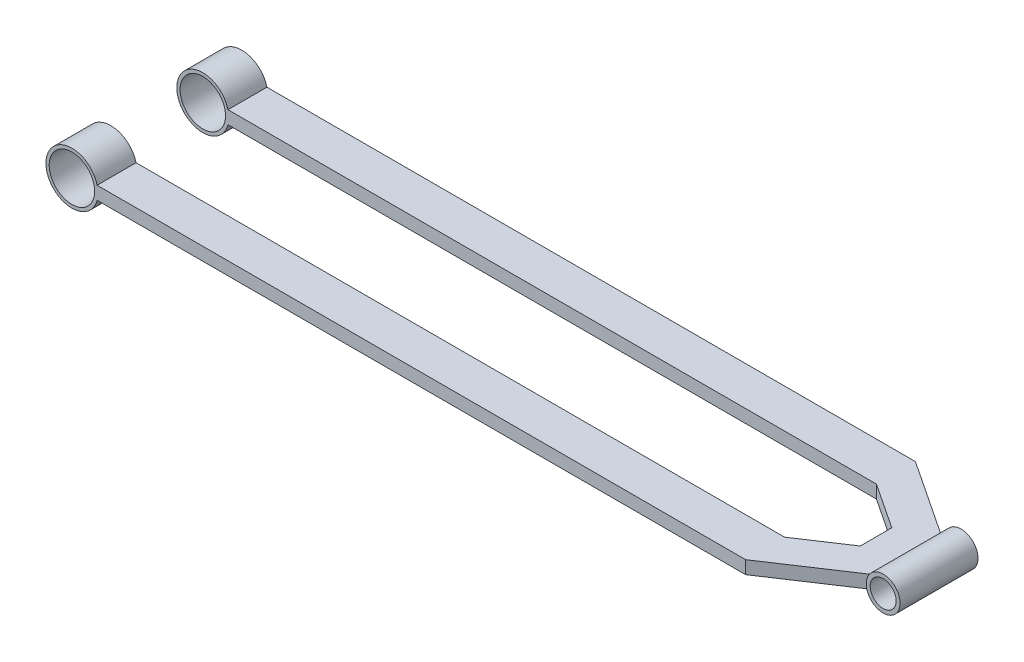
ISO-10303-21;
HEADER;
FILE_DESCRIPTION(('STEP AP214'),'2;1');
FILE_NAME('part.step','',(''),(''),'','','');
FILE_SCHEMA(('AUTOMOTIVE_DESIGN { 1 0 10303 214 1 1 1 1 }'));
ENDSEC;
DATA;
#1=APPLICATION_CONTEXT('core data for automotive mechanical design processes');
#2=APPLICATION_PROTOCOL_DEFINITION('international standard','automotive_design',2000,#1);
#3=PRODUCT_CONTEXT('',#1,'mechanical');
#4=PRODUCT('Part','Part','',(#3));
#5=PRODUCT_RELATED_PRODUCT_CATEGORY('part','',(#4));
#6=PRODUCT_DEFINITION_FORMATION('','',#4);
#7=PRODUCT_DEFINITION_CONTEXT('part definition',#1,'design');
#8=PRODUCT_DEFINITION('design','',#6,#7);
#9=PRODUCT_DEFINITION_SHAPE('','',#8);
#10=(LENGTH_UNIT() NAMED_UNIT(*) SI_UNIT(.MILLI.,.METRE.));
#11=(NAMED_UNIT(*) PLANE_ANGLE_UNIT() SI_UNIT($,.RADIAN.));
#12=(NAMED_UNIT(*) SI_UNIT($,.STERADIAN.) SOLID_ANGLE_UNIT());
#13=UNCERTAINTY_MEASURE_WITH_UNIT(LENGTH_MEASURE(1.E-05),#10,'distance_accuracy_value','');
#14=(GEOMETRIC_REPRESENTATION_CONTEXT(3) GLOBAL_UNCERTAINTY_ASSIGNED_CONTEXT((#13)) GLOBAL_UNIT_ASSIGNED_CONTEXT((#10,
#11,#12)) REPRESENTATION_CONTEXT('',''));
#15=CARTESIAN_POINT('',(0.,0.,0.));
#16=DIRECTION('',(0.,0.,1.));
#17=DIRECTION('',(1.,0.,0.));
#18=AXIS2_PLACEMENT_3D('',#15,#16,#17);
#19=CARTESIAN_POINT('',(0.,5.,0.));
#20=DIRECTION('',(0.,-1.,0.));
#21=DIRECTION('',(0.,0.,-1.));
#22=AXIS2_PLACEMENT_3D('',#19,#20,#21);
#23=PLANE('',#22);
#24=DIRECTION('',(0.,0.,-1.));
#25=VECTOR('',#24,1.);
#26=CARTESIAN_POINT('',(577.,5.,30.));
#27=LINE('',#26,#25);
#28=CARTESIAN_POINT('',(577.,5.,-26.550489952842));
#29=VERTEX_POINT('',#28);
#30=CARTESIAN_POINT('',(577.,5.,26.5504899528419));
#31=VERTEX_POINT('',#30);
#32=EDGE_CURVE('E144',#29,#31,#27,.F.);
#33=ORIENTED_EDGE('',*,*,#32,.F.);
#34=DIRECTION('',(-0.833333333333335,0.,-0.552770798392565));
#35=VECTOR('',#34,1.);
#36=CARTESIAN_POINT('',(578.5,5.,-25.5555025157354));
#37=LINE('',#36,#35);
#38=CARTESIAN_POINT('',(518.5,5.,-65.355));
#39=VERTEX_POINT('',#38);
#40=EDGE_CURVE('E132',#29,#39,#37,.T.);
#41=ORIENTED_EDGE('',*,*,#40,.T.);
#42=DIRECTION('',(-1.,0.,0.));
#43=VECTOR('',#42,1.);
#44=CARTESIAN_POINT('',(18.5,5.,-65.355));
#45=LINE('',#44,#43);
#46=CARTESIAN_POINT('',(19.3649167310371,5.,-65.355));
#47=VERTEX_POINT('',#46);
#48=EDGE_CURVE('E140',#39,#47,#45,.T.);
#49=ORIENTED_EDGE('',*,*,#48,.T.);
#50=DIRECTION('',(0.,0.,1.));
#51=VECTOR('',#50,1.);
#52=CARTESIAN_POINT('',(19.3649167310371,5.,-65.355));
#53=LINE('',#52,#51);
#54=CARTESIAN_POINT('',(19.3649167310371,5.,-35.355));
#55=VERTEX_POINT('',#54);
#56=EDGE_CURVE('E223',#55,#47,#53,.F.);
#57=ORIENTED_EDGE('',*,*,#56,.F.);
#58=DIRECTION('',(1.,0.,0.));
#59=VECTOR('',#58,1.);
#60=CARTESIAN_POINT('',(18.5,5.,-35.355));
#61=LINE('',#60,#59);
#62=CARTESIAN_POINT('',(518.5,5.,-35.355));
#63=VERTEX_POINT('',#62);
#64=EDGE_CURVE('E175',#55,#63,#61,.T.);
#65=ORIENTED_EDGE('',*,*,#64,.T.);
#66=DIRECTION('',(0.833333333333335,0.,0.552770798392565));
#67=VECTOR('',#66,1.);
#68=CARTESIAN_POINT('',(553.5,5.,-12.1386264675124));
#69=LINE('',#68,#67);
#70=CARTESIAN_POINT('',(553.5,5.,-12.1386264675124));
#71=VERTEX_POINT('',#70);
#72=EDGE_CURVE('E177',#63,#71,#69,.T.);
#73=ORIENTED_EDGE('',*,*,#72,.T.);
#74=DIRECTION('',(0.,0.,1.));
#75=VECTOR('',#74,1.);
#76=CARTESIAN_POINT('',(553.5,5.,12.1386264675123));
#77=LINE('',#76,#75);
#78=CARTESIAN_POINT('',(553.5,5.,12.1386264675123));
#79=VERTEX_POINT('',#78);
#80=EDGE_CURVE('E179',#71,#79,#77,.T.);
#81=ORIENTED_EDGE('',*,*,#80,.T.);
#82=DIRECTION('',(-0.833333333333334,0.,0.552770798392566));
#83=VECTOR('',#82,1.);
#84=CARTESIAN_POINT('',(518.5,5.,35.355));
#85=LINE('',#84,#83);
#86=CARTESIAN_POINT('',(518.5,5.,35.355));
#87=VERTEX_POINT('',#86);
#88=EDGE_CURVE('E181',#79,#87,#85,.T.);
#89=ORIENTED_EDGE('',*,*,#88,.T.);
#90=DIRECTION('',(-1.,0.,0.));
#91=VECTOR('',#90,1.);
#92=CARTESIAN_POINT('',(18.5,5.,35.355));
#93=LINE('',#92,#91);
#94=CARTESIAN_POINT('',(19.3649167310371,5.,35.355));
#95=VERTEX_POINT('',#94);
#96=EDGE_CURVE('E183',#87,#95,#93,.T.);
#97=ORIENTED_EDGE('',*,*,#96,.T.);
#98=DIRECTION('',(0.,0.,-1.));
#99=VECTOR('',#98,1.);
#100=CARTESIAN_POINT('',(19.3649167310371,5.,65.355));
#101=LINE('',#100,#99);
#102=CARTESIAN_POINT('',(19.3649167310371,5.,65.355));
#103=VERTEX_POINT('',#102);
#104=EDGE_CURVE('E166',#103,#95,#101,.T.);
#105=ORIENTED_EDGE('',*,*,#104,.F.);
#106=DIRECTION('',(1.,0.,0.));
#107=VECTOR('',#106,1.);
#108=CARTESIAN_POINT('',(18.5,5.,65.355));
#109=LINE('',#108,#107);
#110=CARTESIAN_POINT('',(518.5,5.,65.355));
#111=VERTEX_POINT('',#110);
#112=EDGE_CURVE('E170',#103,#111,#109,.T.);
#113=ORIENTED_EDGE('',*,*,#112,.T.);
#114=DIRECTION('',(0.833333333333334,0.,-0.552770798392566));
#115=VECTOR('',#114,1.);
#116=CARTESIAN_POINT('',(518.5,5.,65.355));
#117=LINE('',#116,#115);
#118=EDGE_CURVE('E141',#111,#31,#117,.T.);
#119=ORIENTED_EDGE('',*,*,#118,.T.);
#120=EDGE_LOOP('',(#33,#41,#49,#57,#65,#73,#81,#89,#97,#105,#113,#119));
#121=FACE_BOUND('',#120,.T.);
#122=ADVANCED_FACE('F41',(#121),#23,.F.);
#123=CARTESIAN_POINT('',(0.,-5.,0.));
#124=DIRECTION('',(0.,-1.,0.));
#125=DIRECTION('',(0.,0.,-1.));
#126=AXIS2_PLACEMENT_3D('',#123,#124,#125);
#127=PLANE('',#126);
#128=DIRECTION('',(-0.833333333333335,0.,-0.552770798392565));
#129=VECTOR('',#128,1.);
#130=CARTESIAN_POINT('',(578.5,-5.,-25.5555025157354));
#131=LINE('',#130,#129);
#132=CARTESIAN_POINT('',(577.,-5.,-26.550489952842));
#133=VERTEX_POINT('',#132);
#134=CARTESIAN_POINT('',(518.5,-5.,-65.355));
#135=VERTEX_POINT('',#134);
#136=EDGE_CURVE('E190',#133,#135,#131,.T.);
#137=ORIENTED_EDGE('',*,*,#136,.F.);
#138=DIRECTION('',(0.,0.,-1.));
#139=VECTOR('',#138,1.);
#140=CARTESIAN_POINT('',(577.,-5.,30.));
#141=LINE('',#140,#139);
#142=CARTESIAN_POINT('',(577.,-5.,26.5504899528419));
#143=VERTEX_POINT('',#142);
#144=EDGE_CURVE('E64',#133,#143,#141,.F.);
#145=ORIENTED_EDGE('',*,*,#144,.T.);
#146=DIRECTION('',(0.833333333333334,0.,-0.552770798392566));
#147=VECTOR('',#146,1.);
#148=CARTESIAN_POINT('',(518.5,-5.,65.355));
#149=LINE('',#148,#147);
#150=CARTESIAN_POINT('',(518.5,-5.,65.355));
#151=VERTEX_POINT('',#150);
#152=EDGE_CURVE('E188',#151,#143,#149,.T.);
#153=ORIENTED_EDGE('',*,*,#152,.F.);
#154=DIRECTION('',(1.,0.,0.));
#155=VECTOR('',#154,1.);
#156=CARTESIAN_POINT('',(18.5,-5.,65.355));
#157=LINE('',#156,#155);
#158=CARTESIAN_POINT('',(19.3649167310371,-5.,65.355));
#159=VERTEX_POINT('',#158);
#160=EDGE_CURVE('E169',#159,#151,#157,.T.);
#161=ORIENTED_EDGE('',*,*,#160,.F.);
#162=DIRECTION('',(0.,0.,-1.));
#163=VECTOR('',#162,1.);
#164=CARTESIAN_POINT('',(19.3649167310371,-5.,65.355));
#165=LINE('',#164,#163);
#166=CARTESIAN_POINT('',(19.3649167310371,-5.,35.355));
#167=VERTEX_POINT('',#166);
#168=EDGE_CURVE('E49',#159,#167,#165,.T.);
#169=ORIENTED_EDGE('',*,*,#168,.T.);
#170=DIRECTION('',(-1.,0.,0.));
#171=VECTOR('',#170,1.);
#172=CARTESIAN_POINT('',(18.5,-5.,35.355));
#173=LINE('',#172,#171);
#174=CARTESIAN_POINT('',(518.5,-5.,35.355));
#175=VERTEX_POINT('',#174);
#176=EDGE_CURVE('E172',#175,#167,#173,.T.);
#177=ORIENTED_EDGE('',*,*,#176,.F.);
#178=DIRECTION('',(-0.833333333333334,0.,0.552770798392566));
#179=VECTOR('',#178,1.);
#180=CARTESIAN_POINT('',(518.5,-5.,35.355));
#181=LINE('',#180,#179);
#182=CARTESIAN_POINT('',(553.5,-5.,12.1386264675123));
#183=VERTEX_POINT('',#182);
#184=EDGE_CURVE('E201',#183,#175,#181,.T.);
#185=ORIENTED_EDGE('',*,*,#184,.F.);
#186=DIRECTION('',(0.,0.,1.));
#187=VECTOR('',#186,1.);
#188=CARTESIAN_POINT('',(553.5,-5.,12.1386264675123));
#189=LINE('',#188,#187);
#190=CARTESIAN_POINT('',(553.5,-5.,-12.1386264675124));
#191=VERTEX_POINT('',#190);
#192=EDGE_CURVE('E199',#191,#183,#189,.T.);
#193=ORIENTED_EDGE('',*,*,#192,.F.);
#194=DIRECTION('',(0.833333333333335,0.,0.552770798392565));
#195=VECTOR('',#194,1.);
#196=CARTESIAN_POINT('',(553.5,-5.,-12.1386264675124));
#197=LINE('',#196,#195);
#198=CARTESIAN_POINT('',(518.5,-5.,-35.355));
#199=VERTEX_POINT('',#198);
#200=EDGE_CURVE('E197',#199,#191,#197,.T.);
#201=ORIENTED_EDGE('',*,*,#200,.F.);
#202=DIRECTION('',(1.,0.,0.));
#203=VECTOR('',#202,1.);
#204=CARTESIAN_POINT('',(18.5,-5.,-35.355));
#205=LINE('',#204,#203);
#206=CARTESIAN_POINT('',(19.3649167310371,-5.,-35.355));
#207=VERTEX_POINT('',#206);
#208=EDGE_CURVE('E195',#207,#199,#205,.T.);
#209=ORIENTED_EDGE('',*,*,#208,.F.);
#210=DIRECTION('',(0.,0.,1.));
#211=VECTOR('',#210,1.);
#212=CARTESIAN_POINT('',(19.3649167310371,-5.,-65.355));
#213=LINE('',#212,#211);
#214=CARTESIAN_POINT('',(19.3649167310371,-5.,-65.355));
#215=VERTEX_POINT('',#214);
#216=EDGE_CURVE('E220',#207,#215,#213,.F.);
#217=ORIENTED_EDGE('',*,*,#216,.T.);
#218=DIRECTION('',(-1.,0.,0.));
#219=VECTOR('',#218,1.);
#220=CARTESIAN_POINT('',(18.5,-5.,-65.355));
#221=LINE('',#220,#219);
#222=EDGE_CURVE('E192',#135,#215,#221,.T.);
#223=ORIENTED_EDGE('',*,*,#222,.F.);
#224=EDGE_LOOP('',(#137,#145,#153,#161,#169,#177,#185,#193,#201,#209,#217,#223));
#225=FACE_BOUND('',#224,.T.);
#226=ADVANCED_FACE('F238',(#225),#127,.T.);
#227=CARTESIAN_POINT('',(0.,0.,-65.355));
#228=DIRECTION('',(0.,0.,1.));
#229=DIRECTION('',(1.,0.,0.));
#230=AXIS2_PLACEMENT_3D('',#227,#228,#229);
#231=CYLINDRICAL_SURFACE('',#230,20.);
#232=CARTESIAN_POINT('',(0.,0.,-35.355));
#233=DIRECTION('',(0.,0.,1.));
#234=DIRECTION('',(1.,0.,0.));
#235=AXIS2_PLACEMENT_3D('',#232,#233,#234);
#236=CIRCLE('',#235,20.);
#237=EDGE_CURVE('E229',#55,#207,#236,.T.);
#238=ORIENTED_EDGE('',*,*,#237,.F.);
#239=ORIENTED_EDGE('',*,*,#56,.T.);
#240=CARTESIAN_POINT('',(0.,0.,-65.355));
#241=DIRECTION('',(0.,0.,1.));
#242=DIRECTION('',(1.,0.,0.));
#243=AXIS2_PLACEMENT_3D('',#240,#241,#242);
#244=CIRCLE('',#243,20.);
#245=EDGE_CURVE('E232',#47,#215,#244,.T.);
#246=ORIENTED_EDGE('',*,*,#245,.T.);
#247=ORIENTED_EDGE('',*,*,#216,.F.);
#248=EDGE_LOOP('',(#238,#239,#246,#247));
#249=FACE_BOUND('',#248,.T.);
#250=ADVANCED_FACE('F43',(#249),#231,.T.);
#251=CARTESIAN_POINT('',(0.,0.,-65.355));
#252=DIRECTION('',(0.,0.,1.));
#253=DIRECTION('',(1.,0.,0.));
#254=AXIS2_PLACEMENT_3D('',#251,#252,#253);
#255=PLANE('',#254);
#256=ORIENTED_EDGE('',*,*,#245,.F.);
#257=ORIENTED_EDGE('',*,*,#48,.F.);
#258=DIRECTION('',(0.,-1.,0.));
#259=VECTOR('',#258,1.);
#260=CARTESIAN_POINT('',(518.5,5.,-65.355));
#261=LINE('',#260,#259);
#262=EDGE_CURVE('E136',#39,#135,#261,.T.);
#263=ORIENTED_EDGE('',*,*,#262,.T.);
#264=ORIENTED_EDGE('',*,*,#222,.T.);
#265=EDGE_LOOP('',(#256,#257,#263,#264));
#266=FACE_BOUND('',#265,.T.);
#267=CARTESIAN_POINT('',(0.,0.,-65.355));
#268=DIRECTION('',(0.,0.,1.));
#269=DIRECTION('',(1.,0.,0.));
#270=AXIS2_PLACEMENT_3D('',#267,#268,#269);
#271=CIRCLE('',#270,17.5);
#272=CARTESIAN_POINT('',(17.5,0.,-65.355));
#273=VERTEX_POINT('',#272);
#274=EDGE_CURVE('E226',#273,#273,#271,.T.);
#275=ORIENTED_EDGE('',*,*,#274,.T.);
#276=EDGE_LOOP('',(#275));
#277=FACE_BOUND('',#276,.T.);
#278=ADVANCED_FACE('F270',(#266,#277),#255,.F.);
#279=CARTESIAN_POINT('',(0.,0.,-35.355));
#280=DIRECTION('',(0.,0.,1.));
#281=DIRECTION('',(1.,0.,0.));
#282=AXIS2_PLACEMENT_3D('',#279,#280,#281);
#283=PLANE('',#282);
#284=ORIENTED_EDGE('',*,*,#237,.T.);
#285=ORIENTED_EDGE('',*,*,#208,.T.);
#286=DIRECTION('',(0.,-1.,0.));
#287=VECTOR('',#286,1.);
#288=CARTESIAN_POINT('',(518.5,5.,-35.355));
#289=LINE('',#288,#287);
#290=EDGE_CURVE('E213',#63,#199,#289,.T.);
#291=ORIENTED_EDGE('',*,*,#290,.F.);
#292=ORIENTED_EDGE('',*,*,#64,.F.);
#293=EDGE_LOOP('',(#284,#285,#291,#292));
#294=FACE_BOUND('',#293,.T.);
#295=CARTESIAN_POINT('',(0.,0.,-35.355));
#296=DIRECTION('',(0.,0.,1.));
#297=DIRECTION('',(1.,0.,0.));
#298=AXIS2_PLACEMENT_3D('',#295,#296,#297);
#299=CIRCLE('',#298,17.5);
#300=CARTESIAN_POINT('',(17.5,0.,-35.355));
#301=VERTEX_POINT('',#300);
#302=EDGE_CURVE('E225',#301,#301,#299,.T.);
#303=ORIENTED_EDGE('',*,*,#302,.F.);
#304=EDGE_LOOP('',(#303));
#305=FACE_BOUND('',#304,.T.);
#306=ADVANCED_FACE('F264',(#294,#305),#283,.T.);
#307=CARTESIAN_POINT('',(0.,0.,-65.355));
#308=DIRECTION('',(0.,0.,1.));
#309=DIRECTION('',(1.,0.,0.));
#310=AXIS2_PLACEMENT_3D('',#307,#308,#309);
#311=CYLINDRICAL_SURFACE('',#310,17.5);
#312=ORIENTED_EDGE('',*,*,#274,.F.);
#313=EDGE_LOOP('',(#312));
#314=FACE_BOUND('',#313,.T.);
#315=ORIENTED_EDGE('',*,*,#302,.T.);
#316=EDGE_LOOP('',(#315));
#317=FACE_BOUND('',#316,.T.);
#318=ADVANCED_FACE('F304',(#314,#317),#311,.F.);
#319=CARTESIAN_POINT('',(18.5,5.,65.355));
#320=DIRECTION('',(0.,0.,-1.));
#321=DIRECTION('',(-1.,0.,0.));
#322=AXIS2_PLACEMENT_3D('',#319,#320,#321);
#323=PLANE('',#322);
#324=ORIENTED_EDGE('',*,*,#112,.F.);
#325=CARTESIAN_POINT('',(0.,0.,65.355));
#326=DIRECTION('',(0.,0.,1.));
#327=DIRECTION('',(1.,0.,0.));
#328=AXIS2_PLACEMENT_3D('',#325,#326,#327);
#329=CIRCLE('',#328,20.);
#330=EDGE_CURVE('E163',#103,#159,#329,.T.);
#331=ORIENTED_EDGE('',*,*,#330,.T.);
#332=ORIENTED_EDGE('',*,*,#160,.T.);
#333=DIRECTION('',(0.,-1.,0.));
#334=VECTOR('',#333,1.);
#335=CARTESIAN_POINT('',(518.5,5.,65.355));
#336=LINE('',#335,#334);
#337=EDGE_CURVE('E217',#111,#151,#336,.T.);
#338=ORIENTED_EDGE('',*,*,#337,.F.);
#339=EDGE_LOOP('',(#324,#331,#332,#338));
#340=FACE_BOUND('',#339,.T.);
#341=CARTESIAN_POINT('',(0.,0.,65.355));
#342=DIRECTION('',(0.,0.,1.));
#343=DIRECTION('',(1.,0.,0.));
#344=AXIS2_PLACEMENT_3D('',#341,#342,#343);
#345=CIRCLE('',#344,17.5);
#346=CARTESIAN_POINT('',(17.5,0.,65.355));
#347=VERTEX_POINT('',#346);
#348=EDGE_CURVE('E157',#347,#347,#345,.T.);
#349=ORIENTED_EDGE('',*,*,#348,.F.);
#350=EDGE_LOOP('',(#349));
#351=FACE_BOUND('',#350,.T.);
#352=ADVANCED_FACE('F301',(#340,#351),#323,.F.);
#353=CARTESIAN_POINT('',(518.5,5.,65.355));
#354=DIRECTION('',(-0.552770798392566,0.,-0.833333333333334));
#355=DIRECTION('',(-0.833333333333334,0.,0.552770798392566));
#356=AXIS2_PLACEMENT_3D('',#353,#354,#355);
#357=PLANE('',#356);
#358=CARTESIAN_POINT('',(589.,0.,18.5905904559889));
#359=DIRECTION('',(-0.552770798392566,0.,-0.833333333333334));
#360=DIRECTION('',(0.833333333333334,0.,-0.552770798392566));
#361=AXIS2_PLACEMENT_3D('',#358,#359,#360);
#362=ELLIPSE('',#361,15.6,13.);
#363=EDGE_CURVE('E56',#31,#143,#362,.F.);
#364=ORIENTED_EDGE('',*,*,#363,.F.);
#365=ORIENTED_EDGE('',*,*,#118,.F.);
#366=ORIENTED_EDGE('',*,*,#337,.T.);
#367=ORIENTED_EDGE('',*,*,#152,.T.);
#368=EDGE_LOOP('',(#364,#365,#366,#367));
#369=FACE_BOUND('',#368,.T.);
#370=ADVANCED_FACE('F298',(#369),#357,.F.);
#371=CARTESIAN_POINT('',(578.5,5.,-25.5555025157354));
#372=DIRECTION('',(-0.552770798392565,0.,0.833333333333335));
#373=DIRECTION('',(0.833333333333335,0.,0.552770798392565));
#374=AXIS2_PLACEMENT_3D('',#371,#372,#373);
#375=PLANE('',#374);
#376=CARTESIAN_POINT('',(589.,0.,-18.5905904559891));
#377=DIRECTION('',(-0.552770798392565,0.,0.833333333333335));
#378=DIRECTION('',(-0.833333333333335,0.,-0.552770798392565));
#379=AXIS2_PLACEMENT_3D('',#376,#377,#378);
#380=ELLIPSE('',#379,15.6,13.);
#381=EDGE_CURVE('E11',#133,#29,#380,.F.);
#382=ORIENTED_EDGE('',*,*,#381,.F.);
#383=ORIENTED_EDGE('',*,*,#136,.T.);
#384=ORIENTED_EDGE('',*,*,#262,.F.);
#385=ORIENTED_EDGE('',*,*,#40,.F.);
#386=EDGE_LOOP('',(#382,#383,#384,#385));
#387=FACE_BOUND('',#386,.T.);
#388=ADVANCED_FACE('F134',(#387),#375,.F.);
#389=CARTESIAN_POINT('',(553.5,5.,-12.1386264675124));
#390=DIRECTION('',(0.552770798392565,0.,-0.833333333333335));
#391=DIRECTION('',(-0.833333333333335,0.,-0.552770798392565));
#392=AXIS2_PLACEMENT_3D('',#389,#390,#391);
#393=PLANE('',#392);
#394=ORIENTED_EDGE('',*,*,#200,.T.);
#395=DIRECTION('',(0.,-1.,0.));
#396=VECTOR('',#395,1.);
#397=CARTESIAN_POINT('',(553.5,5.,-12.1386264675124));
#398=LINE('',#397,#396);
#399=EDGE_CURVE('E210',#71,#191,#398,.T.);
#400=ORIENTED_EDGE('',*,*,#399,.F.);
#401=ORIENTED_EDGE('',*,*,#72,.F.);
#402=ORIENTED_EDGE('',*,*,#290,.T.);
#403=EDGE_LOOP('',(#394,#400,#401,#402));
#404=FACE_BOUND('',#403,.T.);
#405=ADVANCED_FACE('F260',(#404),#393,.F.);
#406=CARTESIAN_POINT('',(553.5,5.,12.1386264675123));
#407=DIRECTION('',(1.,0.,0.));
#408=DIRECTION('',(0.,0.,-1.));
#409=AXIS2_PLACEMENT_3D('',#406,#407,#408);
#410=PLANE('',#409);
#411=ORIENTED_EDGE('',*,*,#192,.T.);
#412=DIRECTION('',(0.,-1.,0.));
#413=VECTOR('',#412,1.);
#414=CARTESIAN_POINT('',(553.5,5.,12.1386264675123));
#415=LINE('',#414,#413);
#416=EDGE_CURVE('E207',#79,#183,#415,.T.);
#417=ORIENTED_EDGE('',*,*,#416,.F.);
#418=ORIENTED_EDGE('',*,*,#80,.F.);
#419=ORIENTED_EDGE('',*,*,#399,.T.);
#420=EDGE_LOOP('',(#411,#417,#418,#419));
#421=FACE_BOUND('',#420,.T.);
#422=ADVANCED_FACE('F255',(#421),#410,.F.);
#423=CARTESIAN_POINT('',(518.5,5.,35.355));
#424=DIRECTION('',(0.552770798392566,0.,0.833333333333334));
#425=DIRECTION('',(0.833333333333334,0.,-0.552770798392566));
#426=AXIS2_PLACEMENT_3D('',#423,#424,#425);
#427=PLANE('',#426);
#428=ORIENTED_EDGE('',*,*,#184,.T.);
#429=DIRECTION('',(0.,-1.,0.));
#430=VECTOR('',#429,1.);
#431=CARTESIAN_POINT('',(518.5,5.,35.355));
#432=LINE('',#431,#430);
#433=EDGE_CURVE('E186',#87,#175,#432,.T.);
#434=ORIENTED_EDGE('',*,*,#433,.F.);
#435=ORIENTED_EDGE('',*,*,#88,.F.);
#436=ORIENTED_EDGE('',*,*,#416,.T.);
#437=EDGE_LOOP('',(#428,#434,#435,#436));
#438=FACE_BOUND('',#437,.T.);
#439=ADVANCED_FACE('F249',(#438),#427,.F.);
#440=CARTESIAN_POINT('',(18.5,5.,35.355));
#441=DIRECTION('',(0.,0.,1.));
#442=DIRECTION('',(1.,0.,0.));
#443=AXIS2_PLACEMENT_3D('',#440,#441,#442);
#444=PLANE('',#443);
#445=ORIENTED_EDGE('',*,*,#176,.T.);
#446=CARTESIAN_POINT('',(0.,0.,35.355));
#447=DIRECTION('',(0.,0.,1.));
#448=DIRECTION('',(1.,0.,0.));
#449=AXIS2_PLACEMENT_3D('',#446,#447,#448);
#450=CIRCLE('',#449,20.);
#451=EDGE_CURVE('E160',#95,#167,#450,.T.);
#452=ORIENTED_EDGE('',*,*,#451,.F.);
#453=ORIENTED_EDGE('',*,*,#96,.F.);
#454=ORIENTED_EDGE('',*,*,#433,.T.);
#455=EDGE_LOOP('',(#445,#452,#453,#454));
#456=FACE_BOUND('',#455,.T.);
#457=CARTESIAN_POINT('',(0.,0.,35.355));
#458=DIRECTION('',(0.,0.,1.));
#459=DIRECTION('',(1.,0.,0.));
#460=AXIS2_PLACEMENT_3D('',#457,#458,#459);
#461=CIRCLE('',#460,17.5);
#462=CARTESIAN_POINT('',(17.5,0.,35.355));
#463=VERTEX_POINT('',#462);
#464=EDGE_CURVE('E156',#463,#463,#461,.T.);
#465=ORIENTED_EDGE('',*,*,#464,.T.);
#466=EDGE_LOOP('',(#465));
#467=FACE_BOUND('',#466,.T.);
#468=ADVANCED_FACE('F243',(#456,#467),#444,.F.);
#469=CARTESIAN_POINT('',(0.,0.,65.355));
#470=DIRECTION('',(0.,0.,-1.));
#471=DIRECTION('',(-1.,0.,0.));
#472=AXIS2_PLACEMENT_3D('',#469,#470,#471);
#473=CYLINDRICAL_SURFACE('',#472,20.);
#474=ORIENTED_EDGE('',*,*,#330,.F.);
#475=ORIENTED_EDGE('',*,*,#104,.T.);
#476=ORIENTED_EDGE('',*,*,#451,.T.);
#477=ORIENTED_EDGE('',*,*,#168,.F.);
#478=EDGE_LOOP('',(#474,#475,#476,#477));
#479=FACE_BOUND('',#478,.T.);
#480=ADVANCED_FACE('F285',(#479),#473,.T.);
#481=CARTESIAN_POINT('',(0.,0.,65.355));
#482=DIRECTION('',(0.,0.,-1.));
#483=DIRECTION('',(-1.,0.,0.));
#484=AXIS2_PLACEMENT_3D('',#481,#482,#483);
#485=CYLINDRICAL_SURFACE('',#484,17.5);
#486=ORIENTED_EDGE('',*,*,#348,.T.);
#487=EDGE_LOOP('',(#486));
#488=FACE_BOUND('',#487,.T.);
#489=ORIENTED_EDGE('',*,*,#464,.F.);
#490=EDGE_LOOP('',(#489));
#491=FACE_BOUND('',#490,.T.);
#492=ADVANCED_FACE('F351',(#488,#491),#485,.F.);
#493=CARTESIAN_POINT('',(589.,0.,30.));
#494=DIRECTION('',(0.,0.,-1.));
#495=DIRECTION('',(-1.,0.,0.));
#496=AXIS2_PLACEMENT_3D('',#493,#494,#495);
#497=CYLINDRICAL_SURFACE('',#496,13.);
#498=CARTESIAN_POINT('',(589.,0.,30.));
#499=DIRECTION('',(0.,0.,1.));
#500=DIRECTION('',(1.,0.,0.));
#501=AXIS2_PLACEMENT_3D('',#498,#499,#500);
#502=CIRCLE('',#501,13.);
#503=CARTESIAN_POINT('',(602.,0.,30.));
#504=VERTEX_POINT('',#503);
#505=EDGE_CURVE('E148',#504,#504,#502,.T.);
#506=ORIENTED_EDGE('',*,*,#505,.F.);
#507=EDGE_LOOP('',(#506));
#508=FACE_BOUND('',#507,.T.);
#509=CARTESIAN_POINT('',(589.,0.,-30.));
#510=DIRECTION('',(0.,0.,1.));
#511=DIRECTION('',(1.,0.,0.));
#512=AXIS2_PLACEMENT_3D('',#509,#510,#511);
#513=CIRCLE('',#512,13.);
#514=CARTESIAN_POINT('',(602.,0.,-30.));
#515=VERTEX_POINT('',#514);
#516=EDGE_CURVE('E151',#515,#515,#513,.T.);
#517=ORIENTED_EDGE('',*,*,#516,.T.);
#518=EDGE_LOOP('',(#517));
#519=FACE_BOUND('',#518,.T.);
#520=ORIENTED_EDGE('',*,*,#32,.T.);
#521=ORIENTED_EDGE('',*,*,#363,.T.);
#522=ORIENTED_EDGE('',*,*,#144,.F.);
#523=ORIENTED_EDGE('',*,*,#381,.T.);
#524=EDGE_LOOP('',(#520,#521,#522,#523));
#525=FACE_BOUND('',#524,.T.);
#526=ADVANCED_FACE('F147',(#508,#519,#525),#497,.T.);
#527=CARTESIAN_POINT('',(589.,0.,30.));
#528=DIRECTION('',(0.,0.,1.));
#529=DIRECTION('',(1.,0.,0.));
#530=AXIS2_PLACEMENT_3D('',#527,#528,#529);
#531=PLANE('',#530);
#532=ORIENTED_EDGE('',*,*,#505,.T.);
#533=EDGE_LOOP('',(#532));
#534=FACE_BOUND('',#533,.T.);
#535=CARTESIAN_POINT('',(589.,0.,30.));
#536=DIRECTION('',(0.,0.,1.));
#537=DIRECTION('',(1.,0.,0.));
#538=AXIS2_PLACEMENT_3D('',#535,#536,#537);
#539=CIRCLE('',#538,9.99999999999998);
#540=CARTESIAN_POINT('',(599.,0.,30.));
#541=VERTEX_POINT('',#540);
#542=EDGE_CURVE('E491',#541,#541,#539,.T.);
#543=ORIENTED_EDGE('',*,*,#542,.F.);
#544=EDGE_LOOP('',(#543));
#545=FACE_BOUND('',#544,.T.);
#546=ADVANCED_FACE('F363',(#534,#545),#531,.T.);
#547=CARTESIAN_POINT('',(589.,0.,-30.));
#548=DIRECTION('',(0.,0.,1.));
#549=DIRECTION('',(1.,0.,0.));
#550=AXIS2_PLACEMENT_3D('',#547,#548,#549);
#551=PLANE('',#550);
#552=ORIENTED_EDGE('',*,*,#516,.F.);
#553=EDGE_LOOP('',(#552));
#554=FACE_BOUND('',#553,.T.);
#555=CARTESIAN_POINT('',(589.,0.,-30.));
#556=DIRECTION('',(0.,0.,1.));
#557=DIRECTION('',(1.,0.,0.));
#558=AXIS2_PLACEMENT_3D('',#555,#556,#557);
#559=CIRCLE('',#558,9.99999999999998);
#560=CARTESIAN_POINT('',(599.,0.,-30.));
#561=VERTEX_POINT('',#560);
#562=EDGE_CURVE('E494',#561,#561,#559,.T.);
#563=ORIENTED_EDGE('',*,*,#562,.T.);
#564=EDGE_LOOP('',(#563));
#565=FACE_BOUND('',#564,.T.);
#566=ADVANCED_FACE('F371',(#554,#565),#551,.F.);
#567=CARTESIAN_POINT('',(589.,0.,30.));
#568=DIRECTION('',(0.,0.,-1.));
#569=DIRECTION('',(-1.,0.,0.));
#570=AXIS2_PLACEMENT_3D('',#567,#568,#569);
#571=CYLINDRICAL_SURFACE('',#570,9.99999999999998);
#572=ORIENTED_EDGE('',*,*,#542,.T.);
#573=EDGE_LOOP('',(#572));
#574=FACE_BOUND('',#573,.T.);
#575=ORIENTED_EDGE('',*,*,#562,.F.);
#576=EDGE_LOOP('',(#575));
#577=FACE_BOUND('',#576,.T.);
#578=ADVANCED_FACE('F379',(#574,#577),#571,.F.);
#579=CLOSED_SHELL('',(#122,#226,#250,#278,#306,#318,#352,#370,#388,#405,#422,#439,#468,#480,
#492,#526,#546,#566,#578));
#580=MANIFOLD_SOLID_BREP('B2',#579);
#581=ADVANCED_BREP_SHAPE_REPRESENTATION('',(#18,#580),#14);
#582=SHAPE_DEFINITION_REPRESENTATION(#9,#581);
ENDSEC;
END-ISO-10303-21;
